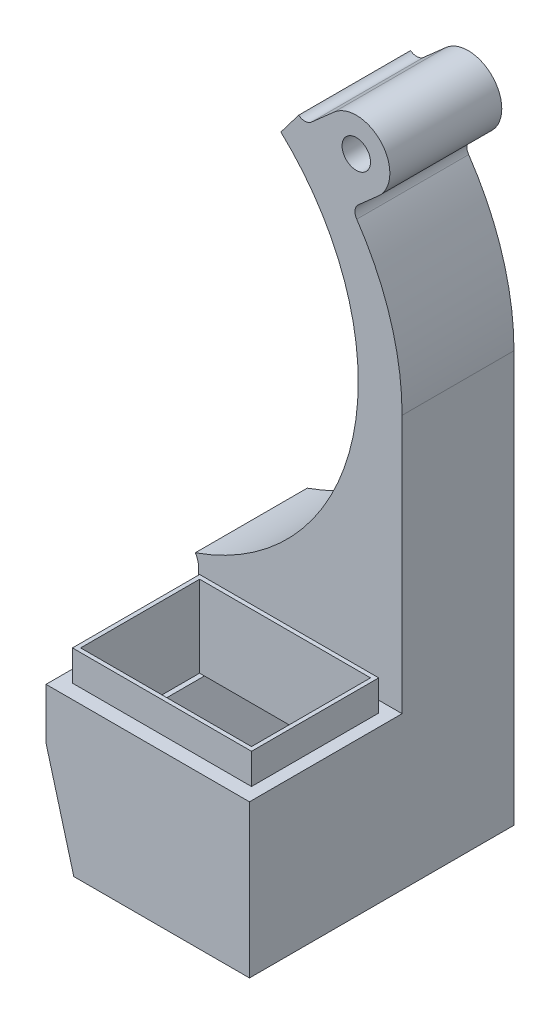
ISO-10303-21;
HEADER;
FILE_DESCRIPTION(('STEP AP214'),'2;1');
FILE_NAME('part.step','',(''),(''),'','','');
FILE_SCHEMA(('AUTOMOTIVE_DESIGN { 1 0 10303 214 1 1 1 1 }'));
ENDSEC;
DATA;
#1=APPLICATION_CONTEXT('core data for automotive mechanical design processes');
#2=APPLICATION_PROTOCOL_DEFINITION('international standard','automotive_design',2000,#1);
#3=PRODUCT_CONTEXT('',#1,'mechanical');
#4=PRODUCT('Part','Part','',(#3));
#5=PRODUCT_RELATED_PRODUCT_CATEGORY('part','',(#4));
#6=PRODUCT_DEFINITION_FORMATION('','',#4);
#7=PRODUCT_DEFINITION_CONTEXT('part definition',#1,'design');
#8=PRODUCT_DEFINITION('design','',#6,#7);
#9=PRODUCT_DEFINITION_SHAPE('','',#8);
#10=(LENGTH_UNIT() NAMED_UNIT(*) SI_UNIT(.MILLI.,.METRE.));
#11=(NAMED_UNIT(*) PLANE_ANGLE_UNIT() SI_UNIT($,.RADIAN.));
#12=(NAMED_UNIT(*) SI_UNIT($,.STERADIAN.) SOLID_ANGLE_UNIT());
#13=UNCERTAINTY_MEASURE_WITH_UNIT(LENGTH_MEASURE(1.E-05),#10,'distance_accuracy_value','');
#14=(GEOMETRIC_REPRESENTATION_CONTEXT(3) GLOBAL_UNCERTAINTY_ASSIGNED_CONTEXT((#13)) GLOBAL_UNIT_ASSIGNED_CONTEXT((#10,
#11,#12)) REPRESENTATION_CONTEXT('',''));
#15=CARTESIAN_POINT('',(0.,0.,0.));
#16=DIRECTION('',(0.,0.,1.));
#17=DIRECTION('',(1.,0.,0.));
#18=AXIS2_PLACEMENT_3D('',#15,#16,#17);
#19=CARTESIAN_POINT('',(2.21102133020147E-13,-22.4,60.));
#20=DIRECTION('',(0.,-1.,0.));
#21=DIRECTION('',(1.,0.,0.));
#22=AXIS2_PLACEMENT_3D('',#19,#20,#21);
#23=PLANE('',#22);
#24=DIRECTION('',(-1.,0.,0.));
#25=VECTOR('',#24,1.);
#26=CARTESIAN_POINT('',(2.22465130032725E-13,-22.4,73.1999999999975));
#27=LINE('',#26,#25);
#28=CARTESIAN_POINT('',(25.9000000525163,-22.3999999999997,73.1999999999975));
#29=VERTEX_POINT('',#28);
#30=CARTESIAN_POINT('',(9.09999999999595,-22.3999999999999,73.1999999999975));
#31=VERTEX_POINT('',#30);
#32=EDGE_CURVE('E246',#29,#31,#27,.T.);
#33=ORIENTED_EDGE('',*,*,#32,.T.);
#34=DIRECTION('',(0.,0.,-1.));
#35=VECTOR('',#34,1.);
#36=CARTESIAN_POINT('',(9.09999999999595,-22.3999999999999,60.));
#37=LINE('',#36,#35);
#38=CARTESIAN_POINT('',(9.09999999999595,-22.3999999999999,61.5000000000002));
#39=VERTEX_POINT('',#38);
#40=EDGE_CURVE('E253',#31,#39,#37,.T.);
#41=ORIENTED_EDGE('',*,*,#40,.T.);
#42=DIRECTION('',(-1.,0.,0.));
#43=VECTOR('',#42,1.);
#44=CARTESIAN_POINT('',(2.21276379797324E-13,-22.4,61.5000000000002));
#45=LINE('',#44,#43);
#46=CARTESIAN_POINT('',(25.9000000525163,-22.3999999999997,61.5000000000002));
#47=VERTEX_POINT('',#46);
#48=EDGE_CURVE('E256',#47,#39,#45,.T.);
#49=ORIENTED_EDGE('',*,*,#48,.F.);
#50=DIRECTION('',(0.,0.,-1.));
#51=VECTOR('',#50,1.);
#52=CARTESIAN_POINT('',(25.9000000525163,-22.3999999999997,60.));
#53=LINE('',#52,#51);
#54=EDGE_CURVE('E259',#29,#47,#53,.T.);
#55=ORIENTED_EDGE('',*,*,#54,.F.);
#56=EDGE_LOOP('',(#33,#41,#49,#55));
#57=FACE_BOUND('',#56,.T.);
#58=DIRECTION('',(0.,0.,1.));
#59=VECTOR('',#58,1.);
#60=CARTESIAN_POINT('',(8.69999999999595,-22.3999999999999,60.));
#61=LINE('',#60,#59);
#62=CARTESIAN_POINT('',(8.69999999999595,-22.3999999999998,61.1000000000002));
#63=VERTEX_POINT('',#62);
#64=CARTESIAN_POINT('',(8.69999999999588,-22.3999999999999,73.5999999999975));
#65=VERTEX_POINT('',#64);
#66=EDGE_CURVE('E47',#63,#65,#61,.T.);
#67=ORIENTED_EDGE('',*,*,#66,.T.);
#68=DIRECTION('',(-1.,0.,0.));
#69=VECTOR('',#68,1.);
#70=CARTESIAN_POINT('',(2.21102133020147E-13,-22.4,73.5999999999975));
#71=LINE('',#70,#69);
#72=CARTESIAN_POINT('',(26.3000000525163,-22.3999999999998,73.5999999999975));
#73=VERTEX_POINT('',#72);
#74=EDGE_CURVE('E390',#73,#65,#71,.T.);
#75=ORIENTED_EDGE('',*,*,#74,.F.);
#76=DIRECTION('',(0.,0.,1.));
#77=VECTOR('',#76,1.);
#78=CARTESIAN_POINT('',(26.3000000525163,-22.3999999999997,60.));
#79=LINE('',#78,#77);
#80=CARTESIAN_POINT('',(26.3000000525163,-22.3999999999997,61.1000000000002));
#81=VERTEX_POINT('',#80);
#82=EDGE_CURVE('E393',#81,#73,#79,.T.);
#83=ORIENTED_EDGE('',*,*,#82,.F.);
#84=DIRECTION('',(-1.,0.,0.));
#85=VECTOR('',#84,1.);
#86=CARTESIAN_POINT('',(2.21102133020147E-13,-22.4,61.1000000000002));
#87=LINE('',#86,#85);
#88=EDGE_CURVE('E396',#81,#63,#87,.T.);
#89=ORIENTED_EDGE('',*,*,#88,.T.);
#90=EDGE_LOOP('',(#67,#75,#83,#89));
#91=FACE_BOUND('',#90,.T.);
#92=ADVANCED_FACE('F39',(#57,#91),#23,.F.);
#93=CARTESIAN_POINT('',(1.18085367454597,0.322571485289525,50.9999999999975));
#94=DIRECTION('',(-0.964655807240221,-0.263513137353184,0.));
#95=DIRECTION('',(0.263513137353184,-0.964655807240221,0.));
#96=AXIS2_PLACEMENT_3D('',#93,#94,#95);
#97=PLANE('',#96);
#98=DIRECTION('',(-0.263513137353184,0.964655807240221,0.));
#99=VECTOR('',#98,1.);
#100=CARTESIAN_POINT('',(1.18085367454597,0.322571485289525,50.9999999999975));
#101=LINE('',#100,#99);
#102=CARTESIAN_POINT('',(12.3049587622228,-40.3999999999999,50.9999999999975));
#103=VERTEX_POINT('',#102);
#104=CARTESIAN_POINT('',(9.57327834963016,-30.3999999999999,50.9999999999975));
#105=VERTEX_POINT('',#104);
#106=EDGE_CURVE('E448',#103,#105,#101,.T.);
#107=ORIENTED_EDGE('',*,*,#106,.T.);
#108=DIRECTION('',(0.,0.,1.));
#109=VECTOR('',#108,1.);
#110=CARTESIAN_POINT('',(9.57327834963016,-30.3999999999999,50.9999999999975));
#111=LINE('',#110,#109);
#112=CARTESIAN_POINT('',(9.57327834963016,-30.3999999999999,61.5000000000002));
#113=VERTEX_POINT('',#112);
#114=EDGE_CURVE('E452',#105,#113,#111,.T.);
#115=ORIENTED_EDGE('',*,*,#114,.T.);
#116=CARTESIAN_POINT('',(9.57327834963012,-30.3999999999997,72.9999999999975));
#117=VERTEX_POINT('',#116);
#118=EDGE_CURVE('E451',#113,#117,#111,.T.);
#119=ORIENTED_EDGE('',*,*,#118,.T.);
#120=DIRECTION('',(-0.259836678581565,0.951197209540902,0.166459511669658));
#121=VECTOR('',#120,1.);
#122=CARTESIAN_POINT('',(17.3392697142688,-58.8293555308979,68.0248627820903));
#123=LINE('',#122,#121);
#124=CARTESIAN_POINT('',(12.3049587622228,-40.3999999999999,71.2499999999975));
#125=VERTEX_POINT('',#124);
#126=EDGE_CURVE('E434',#125,#117,#123,.T.);
#127=ORIENTED_EDGE('',*,*,#126,.F.);
#128=DIRECTION('',(0.,0.,1.));
#129=VECTOR('',#128,1.);
#130=CARTESIAN_POINT('',(12.3049587622228,-40.3999999999999,50.9999999999975));
#131=LINE('',#130,#129);
#132=EDGE_CURVE('E473',#103,#125,#131,.T.);
#133=ORIENTED_EDGE('',*,*,#132,.F.);
#134=EDGE_LOOP('',(#107,#115,#119,#127,#133));
#135=FACE_BOUND('',#134,.T.);
#136=ADVANCED_FACE('F471',(#135),#97,.F.);
#137=CARTESIAN_POINT('',(25.5000000000006,0.,50.9999999999975));
#138=DIRECTION('',(-1.,0.,0.));
#139=DIRECTION('',(0.,0.,-1.));
#140=AXIS2_PLACEMENT_3D('',#137,#138,#139);
#141=PLANE('',#140);
#142=DIRECTION('',(0.,0.,1.));
#143=VECTOR('',#142,1.);
#144=CARTESIAN_POINT('',(25.5000000000006,-40.3999999999999,50.9999999999975));
#145=LINE('',#144,#143);
#146=CARTESIAN_POINT('',(25.5000000000006,-40.3999999999999,50.9999999999975));
#147=VERTEX_POINT('',#146);
#148=CARTESIAN_POINT('',(25.5000000000006,-40.3999999999999,71.2499999999975));
#149=VERTEX_POINT('',#148);
#150=EDGE_CURVE('E474',#147,#149,#145,.T.);
#151=ORIENTED_EDGE('',*,*,#150,.T.);
#152=DIRECTION('',(0.,0.985030467155704,0.172380331752248));
#153=VECTOR('',#152,1.);
#154=CARTESIAN_POINT('',(25.5000000000006,-70.3999999999997,65.9999999999975));
#155=LINE('',#154,#153);
#156=CARTESIAN_POINT('',(25.5000000000006,-30.3999999999997,72.9999999999975));
#157=VERTEX_POINT('',#156);
#158=EDGE_CURVE('E431',#149,#157,#155,.T.);
#159=ORIENTED_EDGE('',*,*,#158,.T.);
#160=DIRECTION('',(0.,0.,1.));
#161=VECTOR('',#160,1.);
#162=CARTESIAN_POINT('',(25.5000000000006,-30.3999999999997,50.9999999999975));
#163=LINE('',#162,#161);
#164=CARTESIAN_POINT('',(25.5000000000006,-30.3999999999997,61.5000000000002));
#165=VERTEX_POINT('',#164);
#166=EDGE_CURVE('E444',#165,#157,#163,.T.);
#167=ORIENTED_EDGE('',*,*,#166,.F.);
#168=CARTESIAN_POINT('',(25.5000000000006,-30.3999999999997,50.9999999999975));
#169=VERTEX_POINT('',#168);
#170=EDGE_CURVE('E445',#169,#165,#163,.T.);
#171=ORIENTED_EDGE('',*,*,#170,.F.);
#172=DIRECTION('',(0.,1.,0.));
#173=VECTOR('',#172,1.);
#174=CARTESIAN_POINT('',(25.5000000000006,0.,50.9999999999975));
#175=LINE('',#174,#173);
#176=EDGE_CURVE('E441',#147,#169,#175,.T.);
#177=ORIENTED_EDGE('',*,*,#176,.F.);
#178=EDGE_LOOP('',(#151,#159,#167,#171,#177));
#179=FACE_BOUND('',#178,.T.);
#180=ADVANCED_FACE('F507',(#179),#141,.T.);
#181=CARTESIAN_POINT('',(3.00150012373459E-13,-30.4,60.));
#182=DIRECTION('',(0.,-1.,0.));
#183=DIRECTION('',(1.,0.,0.));
#184=AXIS2_PLACEMENT_3D('',#181,#182,#183);
#185=PLANE('',#184);
#186=ORIENTED_EDGE('',*,*,#170,.T.);
#187=DIRECTION('',(-1.,0.,0.));
#188=VECTOR('',#187,1.);
#189=CARTESIAN_POINT('',(3.00324259150635E-13,-30.4,61.5000000000002));
#190=LINE('',#189,#188);
#191=EDGE_CURVE('E272',#165,#113,#190,.T.);
#192=ORIENTED_EDGE('',*,*,#191,.T.);
#193=ORIENTED_EDGE('',*,*,#114,.F.);
#194=DIRECTION('',(-1.,0.,0.));
#195=VECTOR('',#194,1.);
#196=CARTESIAN_POINT('',(3.00104357025206E-13,-30.4,50.9999999999975));
#197=LINE('',#196,#195);
#198=EDGE_CURVE('E248',#169,#105,#197,.T.);
#199=ORIENTED_EDGE('',*,*,#198,.F.);
#200=EDGE_LOOP('',(#186,#192,#193,#199));
#201=FACE_BOUND('',#200,.T.);
#202=ADVANCED_FACE('F465',(#201),#185,.T.);
#203=CARTESIAN_POINT('',(0.,0.,50.9999999999975));
#204=DIRECTION('',(0.,0.,-1.));
#205=DIRECTION('',(1.,0.,0.));
#206=AXIS2_PLACEMENT_3D('',#203,#204,#205);
#207=PLANE('',#206);
#208=ORIENTED_EDGE('',*,*,#176,.T.);
#209=ORIENTED_EDGE('',*,*,#198,.T.);
#210=ORIENTED_EDGE('',*,*,#106,.F.);
#211=DIRECTION('',(-1.,0.,0.));
#212=VECTOR('',#211,1.);
#213=CARTESIAN_POINT('',(0.,-40.3999999999999,50.9999999999975));
#214=LINE('',#213,#212);
#215=EDGE_CURVE('E229',#147,#103,#214,.T.);
#216=ORIENTED_EDGE('',*,*,#215,.F.);
#217=EDGE_LOOP('',(#208,#209,#210,#216));
#218=FACE_BOUND('',#217,.T.);
#219=ADVANCED_FACE('F460',(#218),#207,.F.);
#220=CARTESIAN_POINT('',(27.5,2.77965533355339E-13,49.));
#221=DIRECTION('',(-1.,0.,0.));
#222=DIRECTION('',(0.,-1.,0.));
#223=AXIS2_PLACEMENT_3D('',#220,#221,#222);
#224=PLANE('',#223);
#225=DIRECTION('',(0.,1.,0.));
#226=VECTOR('',#225,1.);
#227=CARTESIAN_POINT('',(27.5,2.77965533355339E-13,49.));
#228=LINE('',#227,#226);
#229=CARTESIAN_POINT('',(27.5000054997072,-40.3999999999999,49.));
#230=VERTEX_POINT('',#229);
#231=CARTESIAN_POINT('',(27.5,2.84279978688662E-13,49.));
#232=VERTEX_POINT('',#231);
#233=EDGE_CURVE('E298',#230,#232,#228,.T.);
#234=ORIENTED_EDGE('',*,*,#233,.T.);
#235=DIRECTION('',(0.,0.,1.));
#236=VECTOR('',#235,1.);
#237=CARTESIAN_POINT('',(27.5,2.84279978688662E-13,49.));
#238=LINE('',#237,#236);
#239=CARTESIAN_POINT('',(27.5,2.84279978688662E-13,60.));
#240=VERTEX_POINT('',#239);
#241=EDGE_CURVE('E387',#232,#240,#238,.T.);
#242=ORIENTED_EDGE('',*,*,#241,.T.);
#243=DIRECTION('',(0.,1.,0.));
#244=VECTOR('',#243,1.);
#245=CARTESIAN_POINT('',(27.5,2.77965533355339E-13,60.));
#246=LINE('',#245,#244);
#247=CARTESIAN_POINT('',(27.5000000000003,-25.3999999999997,60.));
#248=VERTEX_POINT('',#247);
#249=EDGE_CURVE('E331',#248,#240,#246,.T.);
#250=ORIENTED_EDGE('',*,*,#249,.F.);
#251=DIRECTION('',(0.,0.,-1.));
#252=VECTOR('',#251,1.);
#253=CARTESIAN_POINT('',(27.5000000000003,-25.3999999999997,60.));
#254=LINE('',#253,#252);
#255=CARTESIAN_POINT('',(27.5000000000003,-25.3999999999997,74.9999999999975));
#256=VERTEX_POINT('',#255);
#257=EDGE_CURVE('E266',#256,#248,#254,.T.);
#258=ORIENTED_EDGE('',*,*,#257,.F.);
#259=DIRECTION('',(0.,1.,0.));
#260=VECTOR('',#259,1.);
#261=CARTESIAN_POINT('',(27.5000000000004,-30.3999999999997,74.9999999999975));
#262=LINE('',#261,#260);
#263=CARTESIAN_POINT('',(27.5000000000006,-40.3999999999999,74.9999999999975));
#264=VERTEX_POINT('',#263);
#265=EDGE_CURVE('E277',#264,#256,#262,.T.);
#266=ORIENTED_EDGE('',*,*,#265,.F.);
#267=DIRECTION('',(0.,0.,1.));
#268=VECTOR('',#267,1.);
#269=CARTESIAN_POINT('',(27.5000000000004,-40.3999999999999,49.));
#270=LINE('',#269,#268);
#271=EDGE_CURVE('E228',#230,#264,#270,.T.);
#272=ORIENTED_EDGE('',*,*,#271,.F.);
#273=EDGE_LOOP('',(#234,#242,#250,#258,#266,#272));
#274=FACE_BOUND('',#273,.T.);
#275=ADVANCED_FACE('F516',(#274),#224,.F.);
#276=CARTESIAN_POINT('',(1.85000000000011,0.0167968750000545,49.));
#277=DIRECTION('',(0.,0.,1.));
#278=DIRECTION('',(-1.,0.,0.));
#279=AXIS2_PLACEMENT_3D('',#276,#277,#278);
#280=CYLINDRICAL_SURFACE('',#279,25.6500054997071);
#281=CARTESIAN_POINT('',(1.85000000000011,0.0167968750000545,60.));
#282=DIRECTION('',(0.,0.,1.));
#283=DIRECTION('',(1.,0.,0.));
#284=AXIS2_PLACEMENT_3D('',#281,#282,#283);
#285=CIRCLE('',#284,25.6500054997071);
#286=CARTESIAN_POINT('',(23.042847290191,14.4662261325746,60.));
#287=VERTEX_POINT('',#286);
#288=EDGE_CURVE('E334',#240,#287,#285,.T.);
#289=ORIENTED_EDGE('',*,*,#288,.F.);
#290=ORIENTED_EDGE('',*,*,#241,.F.);
#291=CARTESIAN_POINT('',(1.85000000000011,0.0167968750000545,49.));
#292=DIRECTION('',(0.,0.,1.));
#293=DIRECTION('',(1.,0.,0.));
#294=AXIS2_PLACEMENT_3D('',#291,#292,#293);
#295=CIRCLE('',#294,25.6500054997071);
#296=CARTESIAN_POINT('',(23.042847290191,14.4662261325746,49.));
#297=VERTEX_POINT('',#296);
#298=EDGE_CURVE('E302',#232,#297,#295,.T.);
#299=ORIENTED_EDGE('',*,*,#298,.T.);
#300=DIRECTION('',(0.,0.,1.));
#301=VECTOR('',#300,1.);
#302=CARTESIAN_POINT('',(23.042847290191,14.4662261325746,49.));
#303=LINE('',#302,#301);
#304=EDGE_CURVE('E384',#297,#287,#303,.T.);
#305=ORIENTED_EDGE('',*,*,#304,.T.);
#306=EDGE_LOOP('',(#289,#290,#299,#305));
#307=FACE_BOUND('',#306,.T.);
#308=ADVANCED_FACE('F765',(#307),#280,.T.);
#309=CARTESIAN_POINT('',(23.8690789762011,15.029556587133,49.));
#310=DIRECTION('',(0.,0.,1.));
#311=DIRECTION('',(-1.,0.,0.));
#312=AXIS2_PLACEMENT_3D('',#309,#310,#311);
#313=CYLINDRICAL_SURFACE('',#312,1.00000000000001);
#314=CARTESIAN_POINT('',(23.8690789762011,15.029556587133,60.));
#315=DIRECTION('',(0.,0.,1.));
#316=DIRECTION('',(1.,0.,0.));
#317=AXIS2_PLACEMENT_3D('',#314,#315,#316);
#318=CIRCLE('',#317,1.00000000000001);
#319=CARTESIAN_POINT('',(23.2068811797294,15.7788856726141,60.));
#320=VERTEX_POINT('',#319);
#321=EDGE_CURVE('E337',#320,#287,#318,.T.);
#322=ORIENTED_EDGE('',*,*,#321,.T.);
#323=ORIENTED_EDGE('',*,*,#304,.F.);
#324=CARTESIAN_POINT('',(23.8690789762011,15.029556587133,49.));
#325=DIRECTION('',(0.,0.,1.));
#326=DIRECTION('',(1.,0.,0.));
#327=AXIS2_PLACEMENT_3D('',#324,#325,#326);
#328=CIRCLE('',#327,1.00000000000001);
#329=CARTESIAN_POINT('',(23.2068811797294,15.7788856726141,49.));
#330=VERTEX_POINT('',#329);
#331=EDGE_CURVE('E305',#330,#297,#328,.T.);
#332=ORIENTED_EDGE('',*,*,#331,.F.);
#333=DIRECTION('',(0.,0.,1.));
#334=VECTOR('',#333,1.);
#335=CARTESIAN_POINT('',(23.2068811797294,15.7788856726141,49.));
#336=LINE('',#335,#334);
#337=EDGE_CURVE('E381',#330,#320,#336,.T.);
#338=ORIENTED_EDGE('',*,*,#337,.T.);
#339=EDGE_LOOP('',(#322,#323,#332,#338));
#340=FACE_BOUND('',#339,.T.);
#341=ADVANCED_FACE('F755',(#340),#313,.F.);
#342=CARTESIAN_POINT('',(2.34680754159689,-2.65559800759642,49.));
#343=DIRECTION('',(0.662197796471719,-0.749329085481139,0.));
#344=DIRECTION('',(0.749329085481139,0.662197796471719,0.));
#345=AXIS2_PLACEMENT_3D('',#342,#343,#344);
#346=PLANE('',#345);
#347=DIRECTION('',(-0.749329085481139,-0.662197796471719,0.));
#348=VECTOR('',#347,1.);
#349=CARTESIAN_POINT('',(2.34680754159689,-2.65559800759642,60.));
#350=LINE('',#349,#348);
#351=CARTESIAN_POINT('',(25.1852527283565,17.5272140179125,60.));
#352=VERTEX_POINT('',#351);
#353=EDGE_CURVE('E339',#352,#320,#350,.T.);
#354=ORIENTED_EDGE('',*,*,#353,.T.);
#355=ORIENTED_EDGE('',*,*,#337,.F.);
#356=DIRECTION('',(-0.749329085481139,-0.662197796471719,0.));
#357=VECTOR('',#356,1.);
#358=CARTESIAN_POINT('',(2.34680754159689,-2.65559800759642,49.));
#359=LINE('',#358,#357);
#360=CARTESIAN_POINT('',(25.1852527283565,17.5272140179125,49.));
#361=VERTEX_POINT('',#360);
#362=EDGE_CURVE('E307',#361,#330,#359,.T.);
#363=ORIENTED_EDGE('',*,*,#362,.F.);
#364=DIRECTION('',(0.,0.,1.));
#365=VECTOR('',#364,1.);
#366=CARTESIAN_POINT('',(25.1852527283565,17.5272140179125,49.));
#367=LINE('',#366,#365);
#368=EDGE_CURVE('E378',#361,#352,#367,.T.);
#369=ORIENTED_EDGE('',*,*,#368,.T.);
#370=EDGE_LOOP('',(#354,#355,#363,#369));
#371=FACE_BOUND('',#370,.T.);
#372=ADVANCED_FACE('F745',(#371),#346,.T.);
#373=CARTESIAN_POINT('',(22.9999999999998,20.0000000000002,49.));
#374=DIRECTION('',(0.,0.,1.));
#375=DIRECTION('',(-1.,0.,0.));
#376=AXIS2_PLACEMENT_3D('',#373,#374,#375);
#377=CYLINDRICAL_SURFACE('',#376,3.3);
#378=CARTESIAN_POINT('',(22.9999999999998,20.0000000000002,60.));
#379=DIRECTION('',(0.,0.,1.));
#380=DIRECTION('',(1.,0.,0.));
#381=AXIS2_PLACEMENT_3D('',#378,#379,#380);
#382=CIRCLE('',#381,3.3);
#383=CARTESIAN_POINT('',(20.8147472716431,22.472785982088,60.));
#384=VERTEX_POINT('',#383);
#385=EDGE_CURVE('E341',#352,#384,#382,.T.);
#386=ORIENTED_EDGE('',*,*,#385,.F.);
#387=ORIENTED_EDGE('',*,*,#368,.F.);
#388=CARTESIAN_POINT('',(22.9999999999998,20.0000000000002,49.));
#389=DIRECTION('',(0.,0.,1.));
#390=DIRECTION('',(1.,0.,0.));
#391=AXIS2_PLACEMENT_3D('',#388,#389,#390);
#392=CIRCLE('',#391,3.3);
#393=CARTESIAN_POINT('',(20.8147472716431,22.472785982088,49.));
#394=VERTEX_POINT('',#393);
#395=EDGE_CURVE('E309',#361,#394,#392,.T.);
#396=ORIENTED_EDGE('',*,*,#395,.T.);
#397=DIRECTION('',(0.,0.,1.));
#398=VECTOR('',#397,1.);
#399=CARTESIAN_POINT('',(20.8147472716431,22.472785982088,49.));
#400=LINE('',#399,#398);
#401=EDGE_CURVE('E375',#394,#384,#400,.T.);
#402=ORIENTED_EDGE('',*,*,#401,.T.);
#403=EDGE_LOOP('',(#386,#387,#396,#402));
#404=FACE_BOUND('',#403,.T.);
#405=ADVANCED_FACE('F735',(#404),#377,.T.);
#406=CARTESIAN_POINT('',(-2.02369791511646,2.28997395657911,49.));
#407=DIRECTION('',(0.662197796471718,-0.74932908548114,0.));
#408=DIRECTION('',(0.74932908548114,0.662197796471718,0.));
#409=AXIS2_PLACEMENT_3D('',#406,#407,#408);
#410=PLANE('',#409);
#411=DIRECTION('',(-0.74932908548114,-0.662197796471718,0.));
#412=VECTOR('',#411,1.);
#413=CARTESIAN_POINT('',(-2.02369791511646,2.28997395657911,60.));
#414=LINE('',#413,#412);
#415=CARTESIAN_POINT('',(18.5989053771655,20.5146001218519,60.));
#416=VERTEX_POINT('',#415);
#417=EDGE_CURVE('E344',#384,#416,#414,.T.);
#418=ORIENTED_EDGE('',*,*,#417,.F.);
#419=ORIENTED_EDGE('',*,*,#401,.F.);
#420=DIRECTION('',(-0.74932908548114,-0.662197796471718,0.));
#421=VECTOR('',#420,1.);
#422=CARTESIAN_POINT('',(-2.02369791511646,2.28997395657911,49.));
#423=LINE('',#422,#421);
#424=CARTESIAN_POINT('',(18.5989053771655,20.5146001218519,49.));
#425=VERTEX_POINT('',#424);
#426=EDGE_CURVE('E312',#394,#425,#423,.T.);
#427=ORIENTED_EDGE('',*,*,#426,.T.);
#428=DIRECTION('',(0.,0.,1.));
#429=VECTOR('',#428,1.);
#430=CARTESIAN_POINT('',(18.5989053771655,20.5146001218519,49.));
#431=LINE('',#430,#429);
#432=EDGE_CURVE('E372',#425,#416,#431,.T.);
#433=ORIENTED_EDGE('',*,*,#432,.T.);
#434=EDGE_LOOP('',(#418,#419,#427,#433));
#435=FACE_BOUND('',#434,.T.);
#436=ADVANCED_FACE('F725',(#435),#410,.F.);
#437=CARTESIAN_POINT('',(17.9367075806938,21.2639292073331,49.));
#438=DIRECTION('',(0.,0.,1.));
#439=DIRECTION('',(-1.,0.,0.));
#440=AXIS2_PLACEMENT_3D('',#437,#438,#439);
#441=CYLINDRICAL_SURFACE('',#440,1.00000000000001);
#442=CARTESIAN_POINT('',(17.9367075806938,21.2639292073331,60.));
#443=DIRECTION('',(0.,0.,1.));
#444=DIRECTION('',(1.,0.,0.));
#445=AXIS2_PLACEMENT_3D('',#442,#443,#444);
#446=CIRCLE('',#445,1.00000000000001);
#447=CARTESIAN_POINT('',(17.333078902986,20.4666636183047,60.));
#448=VERTEX_POINT('',#447);
#449=EDGE_CURVE('E347',#416,#448,#446,.F.);
#450=ORIENTED_EDGE('',*,*,#449,.F.);
#451=ORIENTED_EDGE('',*,*,#432,.F.);
#452=CARTESIAN_POINT('',(17.9367075806938,21.2639292073331,49.));
#453=DIRECTION('',(0.,0.,1.));
#454=DIRECTION('',(1.,0.,0.));
#455=AXIS2_PLACEMENT_3D('',#452,#453,#454);
#456=CIRCLE('',#455,1.00000000000001);
#457=CARTESIAN_POINT('',(17.333078902986,20.4666636183047,49.));
#458=VERTEX_POINT('',#457);
#459=EDGE_CURVE('E315',#425,#458,#456,.F.);
#460=ORIENTED_EDGE('',*,*,#459,.T.);
#461=DIRECTION('',(0.,0.,1.));
#462=VECTOR('',#461,1.);
#463=CARTESIAN_POINT('',(17.333078902986,20.4666636183047,49.));
#464=LINE('',#463,#462);
#465=EDGE_CURVE('E369',#458,#448,#464,.T.);
#466=ORIENTED_EDGE('',*,*,#465,.T.);
#467=EDGE_LOOP('',(#450,#451,#460,#466));
#468=FACE_BOUND('',#467,.T.);
#469=ADVANCED_FACE('F715',(#468),#441,.F.);
#470=CARTESIAN_POINT('',(1.16783644002256,-0.884196653876564,49.));
#471=DIRECTION('',(0.797265589028358,-0.603628677707799,0.));
#472=DIRECTION('',(0.603628677707799,0.797265589028358,0.));
#473=AXIS2_PLACEMENT_3D('',#470,#471,#472);
#474=PLANE('',#473);
#475=DIRECTION('',(-0.603628677707799,-0.797265589028358,0.));
#476=VECTOR('',#475,1.);
#477=CARTESIAN_POINT('',(1.16783644002256,-0.884196653876564,60.));
#478=LINE('',#477,#476);
#479=CARTESIAN_POINT('',(15.5862000144247,18.1594067276303,60.));
#480=VERTEX_POINT('',#479);
#481=EDGE_CURVE('E350',#448,#480,#478,.T.);
#482=ORIENTED_EDGE('',*,*,#481,.F.);
#483=ORIENTED_EDGE('',*,*,#465,.F.);
#484=DIRECTION('',(-0.603628677707799,-0.797265589028358,0.));
#485=VECTOR('',#484,1.);
#486=CARTESIAN_POINT('',(1.16783644002256,-0.884196653876564,49.));
#487=LINE('',#486,#485);
#488=CARTESIAN_POINT('',(15.5862000144247,18.1594067276303,49.));
#489=VERTEX_POINT('',#488);
#490=EDGE_CURVE('E318',#458,#489,#487,.T.);
#491=ORIENTED_EDGE('',*,*,#490,.T.);
#492=DIRECTION('',(0.,0.,1.));
#493=VECTOR('',#492,1.);
#494=CARTESIAN_POINT('',(15.5862000144247,18.1594067276303,49.));
#495=LINE('',#494,#493);
#496=EDGE_CURVE('E366',#489,#480,#495,.T.);
#497=ORIENTED_EDGE('',*,*,#496,.T.);
#498=EDGE_LOOP('',(#482,#483,#491,#497));
#499=FACE_BOUND('',#498,.T.);
#500=ADVANCED_FACE('F705',(#499),#474,.F.);
#501=CARTESIAN_POINT('',(-0.684887777715923,0.68488777771591,49.));
#502=DIRECTION('',(0.,0.,1.));
#503=DIRECTION('',(-1.,0.,0.));
#504=AXIS2_PLACEMENT_3D('',#501,#502,#503);
#505=CYLINDRICAL_SURFACE('',#504,23.8769158492144);
#506=CARTESIAN_POINT('',(-0.684887777715923,0.68488777771591,60.));
#507=DIRECTION('',(0.,0.,1.));
#508=DIRECTION('',(1.,0.,0.));
#509=AXIS2_PLACEMENT_3D('',#506,#507,#508);
#510=CIRCLE('',#509,23.8769158492144);
#511=CARTESIAN_POINT('',(7.17409382346962,-21.8615868616305,60.));
#512=VERTEX_POINT('',#511);
#513=EDGE_CURVE('E353',#480,#512,#510,.F.);
#514=ORIENTED_EDGE('',*,*,#513,.F.);
#515=ORIENTED_EDGE('',*,*,#496,.F.);
#516=CARTESIAN_POINT('',(-0.684887777715923,0.68488777771591,49.));
#517=DIRECTION('',(0.,0.,1.));
#518=DIRECTION('',(1.,0.,0.));
#519=AXIS2_PLACEMENT_3D('',#516,#517,#518);
#520=CIRCLE('',#519,23.8769158492144);
#521=CARTESIAN_POINT('',(7.17409382346962,-21.8615868616305,49.));
#522=VERTEX_POINT('',#521);
#523=EDGE_CURVE('E321',#489,#522,#520,.F.);
#524=ORIENTED_EDGE('',*,*,#523,.T.);
#525=DIRECTION('',(0.,0.,1.));
#526=VECTOR('',#525,1.);
#527=CARTESIAN_POINT('',(7.17409382346962,-21.8615868616305,49.));
#528=LINE('',#527,#526);
#529=EDGE_CURVE('E363',#522,#512,#528,.T.);
#530=ORIENTED_EDGE('',*,*,#529,.T.);
#531=EDGE_LOOP('',(#514,#515,#524,#530));
#532=FACE_BOUND('',#531,.T.);
#533=ADVANCED_FACE('F694',(#532),#505,.F.);
#534=CARTESIAN_POINT('',(5.50000000000022,-22.9558491109207,49.));
#535=DIRECTION('',(0.,0.,1.));
#536=DIRECTION('',(-1.,0.,0.));
#537=AXIS2_PLACEMENT_3D('',#534,#535,#536);
#538=CYLINDRICAL_SURFACE('',#537,2.);
#539=CARTESIAN_POINT('',(5.50000000000022,-22.9558491109207,60.));
#540=DIRECTION('',(0.,0.,1.));
#541=DIRECTION('',(1.,0.,0.));
#542=AXIS2_PLACEMENT_3D('',#539,#540,#541);
#543=CIRCLE('',#542,2.);
#544=CARTESIAN_POINT('',(7.50000000000023,-22.9558491109207,60.));
#545=VERTEX_POINT('',#544);
#546=EDGE_CURVE('E356',#545,#512,#543,.T.);
#547=ORIENTED_EDGE('',*,*,#546,.T.);
#548=ORIENTED_EDGE('',*,*,#529,.F.);
#549=CARTESIAN_POINT('',(5.50000000000022,-22.9558491109207,49.));
#550=DIRECTION('',(0.,0.,1.));
#551=DIRECTION('',(1.,0.,0.));
#552=AXIS2_PLACEMENT_3D('',#549,#550,#551);
#553=CIRCLE('',#552,2.);
#554=CARTESIAN_POINT('',(7.50000000000023,-22.9558491109207,49.));
#555=VERTEX_POINT('',#554);
#556=EDGE_CURVE('E324',#555,#522,#553,.T.);
#557=ORIENTED_EDGE('',*,*,#556,.F.);
#558=DIRECTION('',(0.,0.,1.));
#559=VECTOR('',#558,1.);
#560=CARTESIAN_POINT('',(7.50000000000023,-22.9558491109207,49.));
#561=LINE('',#560,#559);
#562=EDGE_CURVE('E328',#555,#545,#561,.T.);
#563=ORIENTED_EDGE('',*,*,#562,.T.);
#564=EDGE_LOOP('',(#547,#548,#557,#563));
#565=FACE_BOUND('',#564,.T.);
#566=ADVANCED_FACE('F683',(#565),#538,.F.);
#567=CARTESIAN_POINT('',(7.49999999999999,0.,49.));
#568=DIRECTION('',(-1.,0.,0.));
#569=DIRECTION('',(0.,-1.,0.));
#570=AXIS2_PLACEMENT_3D('',#567,#568,#569);
#571=PLANE('',#570);
#572=DIRECTION('',(0.,1.,0.));
#573=VECTOR('',#572,1.);
#574=CARTESIAN_POINT('',(7.49999999999999,0.,60.));
#575=LINE('',#574,#573);
#576=CARTESIAN_POINT('',(7.50000000000025,-25.3999999999999,60.));
#577=VERTEX_POINT('',#576);
#578=EDGE_CURVE('E358',#577,#545,#575,.T.);
#579=ORIENTED_EDGE('',*,*,#578,.T.);
#580=ORIENTED_EDGE('',*,*,#562,.F.);
#581=DIRECTION('',(0.,1.,0.));
#582=VECTOR('',#581,1.);
#583=CARTESIAN_POINT('',(7.49999999999999,0.,49.));
#584=LINE('',#583,#582);
#585=CARTESIAN_POINT('',(7.49999999999611,-30.3999999999999,49.));
#586=VERTEX_POINT('',#585);
#587=EDGE_CURVE('E326',#586,#555,#584,.T.);
#588=ORIENTED_EDGE('',*,*,#587,.F.);
#589=DIRECTION('',(0.,0.,1.));
#590=VECTOR('',#589,1.);
#591=CARTESIAN_POINT('',(7.5000000000003,-30.3999999999999,60.));
#592=LINE('',#591,#590);
#593=CARTESIAN_POINT('',(7.49999999999603,-30.3999999999999,74.9999999999975));
#594=VERTEX_POINT('',#593);
#595=EDGE_CURVE('E263',#586,#594,#592,.T.);
#596=ORIENTED_EDGE('',*,*,#595,.T.);
#597=DIRECTION('',(0.,1.,0.));
#598=VECTOR('',#597,1.);
#599=CARTESIAN_POINT('',(7.49999999999603,-30.3999999999999,74.9999999999975));
#600=LINE('',#599,#598);
#601=CARTESIAN_POINT('',(7.49999999999598,-25.3999999999999,74.9999999999975));
#602=VERTEX_POINT('',#601);
#603=EDGE_CURVE('E242',#594,#602,#600,.T.);
#604=ORIENTED_EDGE('',*,*,#603,.T.);
#605=DIRECTION('',(0.,0.,1.));
#606=VECTOR('',#605,1.);
#607=CARTESIAN_POINT('',(7.50000000000025,-25.3999999999999,60.));
#608=LINE('',#607,#606);
#609=EDGE_CURVE('E262',#577,#602,#608,.T.);
#610=ORIENTED_EDGE('',*,*,#609,.F.);
#611=EDGE_LOOP('',(#579,#580,#588,#596,#604,#610));
#612=FACE_BOUND('',#611,.T.);
#613=ADVANCED_FACE('F673',(#612),#571,.T.);
#614=CARTESIAN_POINT('',(22.9999999999998,20.0000000000002,49.));
#615=DIRECTION('',(0.,0.,1.));
#616=DIRECTION('',(-1.,0.,0.));
#617=AXIS2_PLACEMENT_3D('',#614,#615,#616);
#618=CYLINDRICAL_SURFACE('',#617,1.4);
#619=CARTESIAN_POINT('',(22.9999999999998,20.0000000000002,49.));
#620=DIRECTION('',(0.,0.,1.));
#621=DIRECTION('',(1.,0.,0.));
#622=AXIS2_PLACEMENT_3D('',#619,#620,#621);
#623=CIRCLE('',#622,1.4);
#624=CARTESIAN_POINT('',(24.3999999999998,20.0000000000002,49.));
#625=VERTEX_POINT('',#624);
#626=EDGE_CURVE('E295',#625,#625,#623,.T.);
#627=ORIENTED_EDGE('',*,*,#626,.F.);
#628=EDGE_LOOP('',(#627));
#629=FACE_BOUND('',#628,.T.);
#630=CARTESIAN_POINT('',(22.9999999999998,20.0000000000002,60.));
#631=DIRECTION('',(0.,0.,1.));
#632=DIRECTION('',(1.,0.,0.));
#633=AXIS2_PLACEMENT_3D('',#630,#631,#632);
#634=CIRCLE('',#633,1.4);
#635=CARTESIAN_POINT('',(24.3999999999998,20.0000000000002,60.));
#636=VERTEX_POINT('',#635);
#637=EDGE_CURVE('E292',#636,#636,#634,.T.);
#638=ORIENTED_EDGE('',*,*,#637,.T.);
#639=EDGE_LOOP('',(#638));
#640=FACE_BOUND('',#639,.T.);
#641=ADVANCED_FACE('F41',(#629,#640),#618,.F.);
#642=CARTESIAN_POINT('',(0.,0.,49.));
#643=DIRECTION('',(0.,0.,-1.));
#644=DIRECTION('',(1.,0.,0.));
#645=AXIS2_PLACEMENT_3D('',#642,#643,#644);
#646=PLANE('',#645);
#647=DIRECTION('',(1.,0.,0.));
#648=VECTOR('',#647,1.);
#649=CARTESIAN_POINT('',(0.,-40.3999999999999,49.));
#650=LINE('',#649,#648);
#651=CARTESIAN_POINT('',(10.2316804125886,-40.3999999999999,49.));
#652=VERTEX_POINT('',#651);
#653=EDGE_CURVE('E238',#652,#230,#650,.T.);
#654=ORIENTED_EDGE('',*,*,#653,.F.);
#655=DIRECTION('',(0.263513137353174,-0.964655807240223,0.));
#656=VECTOR('',#655,1.);
#657=CARTESIAN_POINT('',(-0.748457939934082,-0.204454789416728,49.));
#658=LINE('',#657,#656);
#659=EDGE_CURVE('E226',#586,#652,#658,.T.);
#660=ORIENTED_EDGE('',*,*,#659,.F.);
#661=ORIENTED_EDGE('',*,*,#587,.T.);
#662=ORIENTED_EDGE('',*,*,#556,.T.);
#663=ORIENTED_EDGE('',*,*,#523,.F.);
#664=ORIENTED_EDGE('',*,*,#490,.F.);
#665=ORIENTED_EDGE('',*,*,#459,.F.);
#666=ORIENTED_EDGE('',*,*,#426,.F.);
#667=ORIENTED_EDGE('',*,*,#395,.F.);
#668=ORIENTED_EDGE('',*,*,#362,.T.);
#669=ORIENTED_EDGE('',*,*,#331,.T.);
#670=ORIENTED_EDGE('',*,*,#298,.F.);
#671=ORIENTED_EDGE('',*,*,#233,.F.);
#672=EDGE_LOOP('',(#654,#660,#661,#662,#663,#664,#665,#666,#667,#668,#669,#670,#671));
#673=FACE_BOUND('',#672,.T.);
#674=ORIENTED_EDGE('',*,*,#626,.T.);
#675=EDGE_LOOP('',(#674));
#676=FACE_BOUND('',#675,.T.);
#677=ADVANCED_FACE('F496',(#673,#676),#646,.T.);
#678=CARTESIAN_POINT('',(0.,0.,60.));
#679=DIRECTION('',(0.,0.,-1.));
#680=DIRECTION('',(1.,0.,0.));
#681=AXIS2_PLACEMENT_3D('',#678,#679,#680);
#682=PLANE('',#681);
#683=ORIENTED_EDGE('',*,*,#637,.F.);
#684=EDGE_LOOP('',(#683));
#685=FACE_BOUND('',#684,.T.);
#686=ORIENTED_EDGE('',*,*,#249,.T.);
#687=ORIENTED_EDGE('',*,*,#288,.T.);
#688=ORIENTED_EDGE('',*,*,#321,.F.);
#689=ORIENTED_EDGE('',*,*,#353,.F.);
#690=ORIENTED_EDGE('',*,*,#385,.T.);
#691=ORIENTED_EDGE('',*,*,#417,.T.);
#692=ORIENTED_EDGE('',*,*,#449,.T.);
#693=ORIENTED_EDGE('',*,*,#481,.T.);
#694=ORIENTED_EDGE('',*,*,#513,.T.);
#695=ORIENTED_EDGE('',*,*,#546,.F.);
#696=ORIENTED_EDGE('',*,*,#578,.F.);
#697=DIRECTION('',(1.,0.,0.));
#698=VECTOR('',#697,1.);
#699=CARTESIAN_POINT('',(2.51153264851922E-13,-25.4,60.));
#700=LINE('',#699,#698);
#701=EDGE_CURVE('E299',#577,#248,#700,.T.);
#702=ORIENTED_EDGE('',*,*,#701,.T.);
#703=EDGE_LOOP('',(#686,#687,#688,#689,#690,#691,#692,#693,#694,#695,#696,#702));
#704=FACE_BOUND('',#703,.T.);
#705=ADVANCED_FACE('F486',(#685,#704),#682,.F.);
#706=CARTESIAN_POINT('',(2.50745087777639E-13,-25.4,60.));
#707=DIRECTION('',(0.,-1.,0.));
#708=DIRECTION('',(1.,0.,0.));
#709=AXIS2_PLACEMENT_3D('',#706,#707,#708);
#710=PLANE('',#709);
#711=ORIENTED_EDGE('',*,*,#609,.T.);
#712=DIRECTION('',(1.,0.,0.));
#713=VECTOR('',#712,1.);
#714=CARTESIAN_POINT('',(2.50745087777639E-13,-25.4,74.9999999999975));
#715=LINE('',#714,#713);
#716=EDGE_CURVE('E280',#602,#256,#715,.T.);
#717=ORIENTED_EDGE('',*,*,#716,.T.);
#718=ORIENTED_EDGE('',*,*,#257,.T.);
#719=ORIENTED_EDGE('',*,*,#701,.F.);
#720=EDGE_LOOP('',(#711,#717,#718,#719));
#721=FACE_BOUND('',#720,.T.);
#722=DIRECTION('',(-1.,0.,0.));
#723=VECTOR('',#722,1.);
#724=CARTESIAN_POINT('',(2.50745087777639E-13,-25.4,73.5999999999975));
#725=LINE('',#724,#723);
#726=CARTESIAN_POINT('',(26.3000000525163,-25.3999999999997,73.5999999999975));
#727=VERTEX_POINT('',#726);
#728=CARTESIAN_POINT('',(8.69999999999588,-25.3999999999999,73.5999999999975));
#729=VERTEX_POINT('',#728);
#730=EDGE_CURVE('E419',#727,#729,#725,.T.);
#731=ORIENTED_EDGE('',*,*,#730,.T.);
#732=DIRECTION('',(0.,0.,1.));
#733=VECTOR('',#732,1.);
#734=CARTESIAN_POINT('',(8.69999999999598,-25.3999999999999,60.));
#735=LINE('',#734,#733);
#736=CARTESIAN_POINT('',(8.69999999999598,-25.3999999999999,61.1000000000002));
#737=VERTEX_POINT('',#736);
#738=EDGE_CURVE('E411',#737,#729,#735,.T.);
#739=ORIENTED_EDGE('',*,*,#738,.F.);
#740=DIRECTION('',(-1.,0.,0.));
#741=VECTOR('',#740,1.);
#742=CARTESIAN_POINT('',(2.50745087777639E-13,-25.4,61.1000000000002));
#743=LINE('',#742,#741);
#744=CARTESIAN_POINT('',(26.3000000525163,-25.3999999999997,61.1000000000002));
#745=VERTEX_POINT('',#744);
#746=EDGE_CURVE('E416',#745,#737,#743,.T.);
#747=ORIENTED_EDGE('',*,*,#746,.F.);
#748=DIRECTION('',(0.,0.,1.));
#749=VECTOR('',#748,1.);
#750=CARTESIAN_POINT('',(26.3000000525163,-25.3999999999997,60.));
#751=LINE('',#750,#749);
#752=EDGE_CURVE('E426',#745,#727,#751,.T.);
#753=ORIENTED_EDGE('',*,*,#752,.T.);
#754=EDGE_LOOP('',(#731,#739,#747,#753));
#755=FACE_BOUND('',#754,.T.);
#756=ADVANCED_FACE('F483',(#721,#755),#710,.F.);
#757=CARTESIAN_POINT('',(3.01513009386036E-13,-30.4,73.1999999999975));
#758=DIRECTION('',(0.,0.,1.));
#759=DIRECTION('',(-1.,0.,0.));
#760=AXIS2_PLACEMENT_3D('',#757,#758,#759);
#761=PLANE('',#760);
#762=DIRECTION('',(0.,1.,0.));
#763=VECTOR('',#762,1.);
#764=CARTESIAN_POINT('',(25.9000000525164,-30.3999999999997,73.1999999999975));
#765=LINE('',#764,#763);
#766=CARTESIAN_POINT('',(25.9000000525164,-30.3999999999997,73.1999999999975));
#767=VERTEX_POINT('',#766);
#768=EDGE_CURVE('E284',#767,#29,#765,.T.);
#769=ORIENTED_EDGE('',*,*,#768,.F.);
#770=DIRECTION('',(-1.,0.,0.));
#771=VECTOR('',#770,1.);
#772=CARTESIAN_POINT('',(3.01513009386036E-13,-30.4,73.1999999999975));
#773=LINE('',#772,#771);
#774=CARTESIAN_POINT('',(9.09999999999603,-30.3999999999999,73.1999999999975));
#775=VERTEX_POINT('',#774);
#776=EDGE_CURVE('E265',#767,#775,#773,.T.);
#777=ORIENTED_EDGE('',*,*,#776,.T.);
#778=DIRECTION('',(0.,1.,0.));
#779=VECTOR('',#778,1.);
#780=CARTESIAN_POINT('',(9.09999999999603,-30.3999999999999,73.1999999999975));
#781=LINE('',#780,#779);
#782=EDGE_CURVE('E290',#775,#31,#781,.T.);
#783=ORIENTED_EDGE('',*,*,#782,.T.);
#784=ORIENTED_EDGE('',*,*,#32,.F.);
#785=EDGE_LOOP('',(#769,#777,#783,#784));
#786=FACE_BOUND('',#785,.T.);
#787=ADVANCED_FACE('F485',(#786),#761,.F.);
#788=CARTESIAN_POINT('',(9.09999999999603,-30.3999999999999,60.));
#789=DIRECTION('',(-1.,0.,0.));
#790=DIRECTION('',(0.,-1.,0.));
#791=AXIS2_PLACEMENT_3D('',#788,#789,#790);
#792=PLANE('',#791);
#793=ORIENTED_EDGE('',*,*,#782,.F.);
#794=DIRECTION('',(0.,0.,-1.));
#795=VECTOR('',#794,1.);
#796=CARTESIAN_POINT('',(9.09999999999603,-30.3999999999999,60.));
#797=LINE('',#796,#795);
#798=CARTESIAN_POINT('',(9.09999999999603,-30.3999999999999,61.5000000000002));
#799=VERTEX_POINT('',#798);
#800=EDGE_CURVE('E269',#775,#799,#797,.T.);
#801=ORIENTED_EDGE('',*,*,#800,.T.);
#802=DIRECTION('',(0.,1.,0.));
#803=VECTOR('',#802,1.);
#804=CARTESIAN_POINT('',(9.09999999999603,-30.3999999999999,61.5000000000002));
#805=LINE('',#804,#803);
#806=EDGE_CURVE('E288',#799,#39,#805,.T.);
#807=ORIENTED_EDGE('',*,*,#806,.T.);
#808=ORIENTED_EDGE('',*,*,#40,.F.);
#809=EDGE_LOOP('',(#793,#801,#807,#808));
#810=FACE_BOUND('',#809,.T.);
#811=ADVANCED_FACE('F493',(#810),#792,.F.);
#812=CARTESIAN_POINT('',(3.00324259150635E-13,-30.4,61.5000000000002));
#813=DIRECTION('',(0.,0.,1.));
#814=DIRECTION('',(-1.,0.,0.));
#815=AXIS2_PLACEMENT_3D('',#812,#813,#814);
#816=PLANE('',#815);
#817=ORIENTED_EDGE('',*,*,#806,.F.);
#818=DIRECTION('',(-1.,0.,0.));
#819=VECTOR('',#818,1.);
#820=CARTESIAN_POINT('',(3.00324259150635E-13,-30.4,61.5000000000002));
#821=LINE('',#820,#819);
#822=EDGE_CURVE('E455',#113,#799,#821,.T.);
#823=ORIENTED_EDGE('',*,*,#822,.F.);
#824=ORIENTED_EDGE('',*,*,#191,.F.);
#825=CARTESIAN_POINT('',(25.9000000525164,-30.3999999999997,61.5000000000002));
#826=VERTEX_POINT('',#825);
#827=EDGE_CURVE('E273',#826,#165,#190,.T.);
#828=ORIENTED_EDGE('',*,*,#827,.F.);
#829=DIRECTION('',(0.,1.,0.));
#830=VECTOR('',#829,1.);
#831=CARTESIAN_POINT('',(25.9000000525164,-30.3999999999997,61.5000000000002));
#832=LINE('',#831,#830);
#833=EDGE_CURVE('E286',#826,#47,#832,.T.);
#834=ORIENTED_EDGE('',*,*,#833,.T.);
#835=ORIENTED_EDGE('',*,*,#48,.T.);
#836=EDGE_LOOP('',(#817,#823,#824,#828,#834,#835));
#837=FACE_BOUND('',#836,.T.);
#838=ADVANCED_FACE('F544',(#837),#816,.T.);
#839=CARTESIAN_POINT('',(3.00150012373459E-13,-30.4,74.9999999999975));
#840=DIRECTION('',(0.,0.,-1.));
#841=DIRECTION('',(1.,0.,0.));
#842=AXIS2_PLACEMENT_3D('',#839,#840,#841);
#843=PLANE('',#842);
#844=ORIENTED_EDGE('',*,*,#265,.T.);
#845=ORIENTED_EDGE('',*,*,#716,.F.);
#846=ORIENTED_EDGE('',*,*,#603,.F.);
#847=DIRECTION('',(0.263513137353174,-0.964655807240223,0.));
#848=VECTOR('',#847,1.);
#849=CARTESIAN_POINT('',(-0.748457939934082,-0.204454789416728,74.9999999999975));
#850=LINE('',#849,#848);
#851=CARTESIAN_POINT('',(10.2316804125886,-40.3999999999999,74.9999999999975));
#852=VERTEX_POINT('',#851);
#853=EDGE_CURVE('E224',#594,#852,#850,.T.);
#854=ORIENTED_EDGE('',*,*,#853,.T.);
#855=DIRECTION('',(1.,0.,0.));
#856=VECTOR('',#855,1.);
#857=CARTESIAN_POINT('',(0.,-40.3999999999999,74.9999999999975));
#858=LINE('',#857,#856);
#859=EDGE_CURVE('E232',#852,#264,#858,.T.);
#860=ORIENTED_EDGE('',*,*,#859,.T.);
#861=EDGE_LOOP('',(#844,#845,#846,#854,#860));
#862=FACE_BOUND('',#861,.T.);
#863=ADVANCED_FACE('F240',(#862),#843,.F.);
#864=CARTESIAN_POINT('',(25.9000000525164,-30.3999999999997,60.));
#865=DIRECTION('',(-1.,0.,0.));
#866=DIRECTION('',(0.,-1.,0.));
#867=AXIS2_PLACEMENT_3D('',#864,#865,#866);
#868=PLANE('',#867);
#869=ORIENTED_EDGE('',*,*,#833,.F.);
#870=DIRECTION('',(0.,0.,-1.));
#871=VECTOR('',#870,1.);
#872=CARTESIAN_POINT('',(25.9000000525164,-30.3999999999997,60.));
#873=LINE('',#872,#871);
#874=EDGE_CURVE('E275',#767,#826,#873,.T.);
#875=ORIENTED_EDGE('',*,*,#874,.F.);
#876=ORIENTED_EDGE('',*,*,#768,.T.);
#877=ORIENTED_EDGE('',*,*,#54,.T.);
#878=EDGE_LOOP('',(#869,#875,#876,#877));
#879=FACE_BOUND('',#878,.T.);
#880=ADVANCED_FACE('F527',(#879),#868,.T.);
#881=CARTESIAN_POINT('',(3.00104357025206E-13,-30.4,72.9999999999975));
#882=DIRECTION('',(0.,-1.,0.));
#883=DIRECTION('',(1.,0.,0.));
#884=AXIS2_PLACEMENT_3D('',#881,#882,#883);
#885=PLANE('',#884);
#886=ORIENTED_EDGE('',*,*,#776,.F.);
#887=ORIENTED_EDGE('',*,*,#874,.T.);
#888=ORIENTED_EDGE('',*,*,#827,.T.);
#889=ORIENTED_EDGE('',*,*,#166,.T.);
#890=DIRECTION('',(-1.,0.,0.));
#891=VECTOR('',#890,1.);
#892=CARTESIAN_POINT('',(3.00104357025206E-13,-30.4,72.9999999999975));
#893=LINE('',#892,#891);
#894=EDGE_CURVE('E244',#157,#117,#893,.T.);
#895=ORIENTED_EDGE('',*,*,#894,.T.);
#896=ORIENTED_EDGE('',*,*,#118,.F.);
#897=ORIENTED_EDGE('',*,*,#822,.T.);
#898=ORIENTED_EDGE('',*,*,#800,.F.);
#899=EDGE_LOOP('',(#886,#887,#888,#889,#895,#896,#897,#898));
#900=FACE_BOUND('',#899,.T.);
#901=ADVANCED_FACE('F525',(#900),#885,.F.);
#902=CARTESIAN_POINT('',(-0.748457939934082,-0.204454789416728,72.9999999999975));
#903=DIRECTION('',(0.964655807240223,0.263513137353174,0.));
#904=DIRECTION('',(-0.263513137353174,0.964655807240223,0.));
#905=AXIS2_PLACEMENT_3D('',#902,#903,#904);
#906=PLANE('',#905);
#907=ORIENTED_EDGE('',*,*,#853,.F.);
#908=ORIENTED_EDGE('',*,*,#595,.F.);
#909=ORIENTED_EDGE('',*,*,#659,.T.);
#910=DIRECTION('',(0.,0.,-1.));
#911=VECTOR('',#910,1.);
#912=CARTESIAN_POINT('',(10.2316804125886,-40.3999999999999,72.9999999999975));
#913=LINE('',#912,#911);
#914=EDGE_CURVE('E54',#852,#652,#913,.T.);
#915=ORIENTED_EDGE('',*,*,#914,.F.);
#916=EDGE_LOOP('',(#907,#908,#909,#915));
#917=FACE_BOUND('',#916,.T.);
#918=ADVANCED_FACE('F221',(#917),#906,.F.);
#919=CARTESIAN_POINT('',(-26.3151614592891,-70.3999999999997,65.9999999999975));
#920=DIRECTION('',(0.,-0.172380331752248,0.985030467155704));
#921=DIRECTION('',(0.,0.985030467155704,0.172380331752248));
#922=AXIS2_PLACEMENT_3D('',#919,#920,#921);
#923=PLANE('',#922);
#924=ORIENTED_EDGE('',*,*,#126,.T.);
#925=ORIENTED_EDGE('',*,*,#894,.F.);
#926=ORIENTED_EDGE('',*,*,#158,.F.);
#927=DIRECTION('',(1.,0.,0.));
#928=VECTOR('',#927,1.);
#929=CARTESIAN_POINT('',(-26.3151614592891,-40.3999999999999,71.2499999999975));
#930=LINE('',#929,#928);
#931=EDGE_CURVE('E11',#125,#149,#930,.T.);
#932=ORIENTED_EDGE('',*,*,#931,.F.);
#933=EDGE_LOOP('',(#924,#925,#926,#932));
#934=FACE_BOUND('',#933,.T.);
#935=ADVANCED_FACE('F523',(#934),#923,.F.);
#936=CARTESIAN_POINT('',(8.69999999999588,-15.3999999999999,60.));
#937=DIRECTION('',(-1.,0.,0.));
#938=DIRECTION('',(0.,-1.,0.));
#939=AXIS2_PLACEMENT_3D('',#936,#937,#938);
#940=PLANE('',#939);
#941=ORIENTED_EDGE('',*,*,#66,.F.);
#942=DIRECTION('',(0.,-1.,0.));
#943=VECTOR('',#942,1.);
#944=CARTESIAN_POINT('',(8.69999999999588,-15.3999999999999,61.1000000000002));
#945=LINE('',#944,#943);
#946=EDGE_CURVE('E407',#63,#737,#945,.T.);
#947=ORIENTED_EDGE('',*,*,#946,.T.);
#948=ORIENTED_EDGE('',*,*,#738,.T.);
#949=DIRECTION('',(0.,-1.,0.));
#950=VECTOR('',#949,1.);
#951=CARTESIAN_POINT('',(8.69999999999588,-15.3999999999999,73.5999999999975));
#952=LINE('',#951,#950);
#953=EDGE_CURVE('E409',#65,#729,#952,.T.);
#954=ORIENTED_EDGE('',*,*,#953,.F.);
#955=EDGE_LOOP('',(#941,#947,#948,#954));
#956=FACE_BOUND('',#955,.T.);
#957=ADVANCED_FACE('F405',(#956),#940,.T.);
#958=CARTESIAN_POINT('',(1.51935238586E-13,-15.4,61.1000000000002));
#959=DIRECTION('',(0.,0.,-1.));
#960=DIRECTION('',(1.,0.,0.));
#961=AXIS2_PLACEMENT_3D('',#958,#959,#960);
#962=PLANE('',#961);
#963=ORIENTED_EDGE('',*,*,#88,.F.);
#964=DIRECTION('',(0.,-1.,0.));
#965=VECTOR('',#964,1.);
#966=CARTESIAN_POINT('',(26.3000000525162,-15.3999999999997,61.1000000000002));
#967=LINE('',#966,#965);
#968=EDGE_CURVE('E423',#81,#745,#967,.T.);
#969=ORIENTED_EDGE('',*,*,#968,.T.);
#970=ORIENTED_EDGE('',*,*,#746,.T.);
#971=ORIENTED_EDGE('',*,*,#946,.F.);
#972=EDGE_LOOP('',(#963,#969,#970,#971));
#973=FACE_BOUND('',#972,.T.);
#974=ADVANCED_FACE('F430',(#973),#962,.T.);
#975=CARTESIAN_POINT('',(26.3000000525162,-15.3999999999997,60.));
#976=DIRECTION('',(-1.,0.,0.));
#977=DIRECTION('',(0.,-1.,0.));
#978=AXIS2_PLACEMENT_3D('',#975,#976,#977);
#979=PLANE('',#978);
#980=ORIENTED_EDGE('',*,*,#968,.F.);
#981=ORIENTED_EDGE('',*,*,#82,.T.);
#982=DIRECTION('',(0.,-1.,0.));
#983=VECTOR('',#982,1.);
#984=CARTESIAN_POINT('',(26.3000000525162,-15.3999999999997,73.5999999999975));
#985=LINE('',#984,#983);
#986=EDGE_CURVE('E415',#73,#727,#985,.T.);
#987=ORIENTED_EDGE('',*,*,#986,.T.);
#988=ORIENTED_EDGE('',*,*,#752,.F.);
#989=EDGE_LOOP('',(#980,#981,#987,#988));
#990=FACE_BOUND('',#989,.T.);
#991=ADVANCED_FACE('F425',(#990),#979,.F.);
#992=CARTESIAN_POINT('',(1.51935238586E-13,-15.4,73.5999999999975));
#993=DIRECTION('',(0.,0.,-1.));
#994=DIRECTION('',(1.,0.,0.));
#995=AXIS2_PLACEMENT_3D('',#992,#993,#994);
#996=PLANE('',#995);
#997=ORIENTED_EDGE('',*,*,#986,.F.);
#998=ORIENTED_EDGE('',*,*,#74,.T.);
#999=ORIENTED_EDGE('',*,*,#953,.T.);
#1000=ORIENTED_EDGE('',*,*,#730,.F.);
#1001=EDGE_LOOP('',(#997,#998,#999,#1000));
#1002=FACE_BOUND('',#1001,.T.);
#1003=ADVANCED_FACE('F418',(#1002),#996,.F.);
#1004=CARTESIAN_POINT('',(0.,-40.3999999999999,49.));
#1005=DIRECTION('',(0.,1.,0.));
#1006=DIRECTION('',(-1.,0.,0.));
#1007=AXIS2_PLACEMENT_3D('',#1004,#1005,#1006);
#1008=PLANE('',#1007);
#1009=ORIENTED_EDGE('',*,*,#150,.F.);
#1010=ORIENTED_EDGE('',*,*,#215,.T.);
#1011=ORIENTED_EDGE('',*,*,#132,.T.);
#1012=ORIENTED_EDGE('',*,*,#931,.T.);
#1013=EDGE_LOOP('',(#1009,#1010,#1011,#1012));
#1014=FACE_BOUND('',#1013,.T.);
#1015=ORIENTED_EDGE('',*,*,#653,.T.);
#1016=ORIENTED_EDGE('',*,*,#271,.T.);
#1017=ORIENTED_EDGE('',*,*,#859,.F.);
#1018=ORIENTED_EDGE('',*,*,#914,.T.);
#1019=EDGE_LOOP('',(#1015,#1016,#1017,#1018));
#1020=FACE_BOUND('',#1019,.T.);
#1021=ADVANCED_FACE('F233',(#1014,#1020),#1008,.F.);
#1022=CLOSED_SHELL('',(#92,#136,#180,#202,#219,#275,#308,#341,#372,#405,#436,#469,#500,#533,
#566,#613,#641,#677,#705,#756,#787,#811,#838,#863,#880,#901,#918,#935,#957,#974,#991,#1003,#1021));
#1023=MANIFOLD_SOLID_BREP('B2',#1022);
#1024=ADVANCED_BREP_SHAPE_REPRESENTATION('',(#18,#1023),#14);
#1025=SHAPE_DEFINITION_REPRESENTATION(#9,#1024);
ENDSEC;
END-ISO-10303-21;
